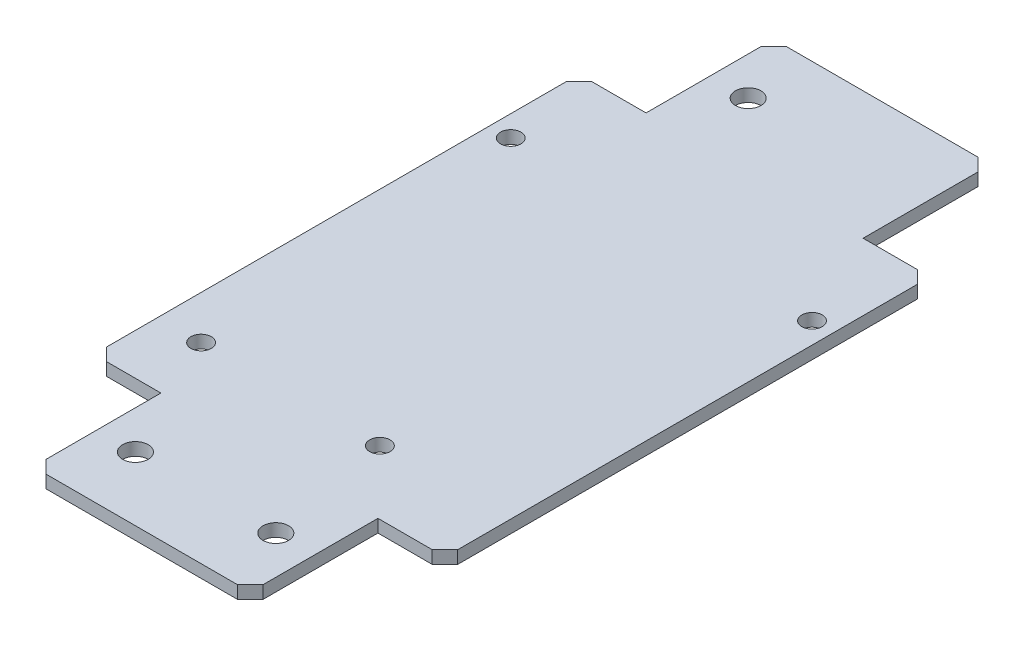
ISO-10303-21;
HEADER;
FILE_DESCRIPTION(('STEP AP214'),'2;1');
FILE_NAME('part.step','',(''),(''),'','','');
FILE_SCHEMA(('AUTOMOTIVE_DESIGN { 1 0 10303 214 1 1 1 1 }'));
ENDSEC;
DATA;
#1=APPLICATION_CONTEXT('core data for automotive mechanical design processes');
#2=APPLICATION_PROTOCOL_DEFINITION('international standard','automotive_design',2000,#1);
#3=PRODUCT_CONTEXT('',#1,'mechanical');
#4=PRODUCT('Part','Part','',(#3));
#5=PRODUCT_RELATED_PRODUCT_CATEGORY('part','',(#4));
#6=PRODUCT_DEFINITION_FORMATION('','',#4);
#7=PRODUCT_DEFINITION_CONTEXT('part definition',#1,'design');
#8=PRODUCT_DEFINITION('design','',#6,#7);
#9=PRODUCT_DEFINITION_SHAPE('','',#8);
#10=(LENGTH_UNIT() NAMED_UNIT(*) SI_UNIT(.MILLI.,.METRE.));
#11=(NAMED_UNIT(*) PLANE_ANGLE_UNIT() SI_UNIT($,.RADIAN.));
#12=(NAMED_UNIT(*) SI_UNIT($,.STERADIAN.) SOLID_ANGLE_UNIT());
#13=UNCERTAINTY_MEASURE_WITH_UNIT(LENGTH_MEASURE(1.E-05),#10,'distance_accuracy_value','');
#14=(GEOMETRIC_REPRESENTATION_CONTEXT(3) GLOBAL_UNCERTAINTY_ASSIGNED_CONTEXT((#13)) GLOBAL_UNIT_ASSIGNED_CONTEXT((#10,
#11,#12)) REPRESENTATION_CONTEXT('',''));
#15=CARTESIAN_POINT('',(0.,0.,0.));
#16=DIRECTION('',(0.,0.,1.));
#17=DIRECTION('',(1.,0.,0.));
#18=AXIS2_PLACEMENT_3D('',#15,#16,#17);
#19=CARTESIAN_POINT('',(0.,52.6628022130798,0.));
#20=DIRECTION('',(0.,1.,0.));
#21=DIRECTION('',(-1.,0.,0.));
#22=AXIS2_PLACEMENT_3D('',#19,#20,#21);
#23=PLANE('',#22);
#24=CARTESIAN_POINT('',(-92.9032323710013,52.6628022130797,54.));
#25=DIRECTION('',(0.,1.,0.));
#26=DIRECTION('',(-1.,0.,0.));
#27=AXIS2_PLACEMENT_3D('',#24,#25,#26);
#28=CIRCLE('',#27,1.60000000000148);
#29=CARTESIAN_POINT('',(-94.5032323710028,52.6628022130797,54.));
#30=VERTEX_POINT('',#29);
#31=EDGE_CURVE('E271',#30,#30,#28,.T.);
#32=ORIENTED_EDGE('',*,*,#31,.F.);
#33=EDGE_LOOP('',(#32));
#34=FACE_BOUND('',#33,.T.);
#35=CARTESIAN_POINT('',(-61.4032323710013,52.6628022130797,106.));
#36=DIRECTION('',(0.,1.,0.));
#37=DIRECTION('',(-1.,0.,0.));
#38=AXIS2_PLACEMENT_3D('',#35,#36,#37);
#39=CIRCLE('',#38,1.60000000000148);
#40=CARTESIAN_POINT('',(-63.0032323710028,52.6628022130797,106.));
#41=VERTEX_POINT('',#40);
#42=EDGE_CURVE('E483',#41,#41,#39,.T.);
#43=ORIENTED_EDGE('',*,*,#42,.F.);
#44=EDGE_LOOP('',(#43));
#45=FACE_BOUND('',#44,.T.);
#46=CARTESIAN_POINT('',(-89.4032323710013,52.6628022130797,106.));
#47=DIRECTION('',(0.,1.,0.));
#48=DIRECTION('',(-1.,0.,0.));
#49=AXIS2_PLACEMENT_3D('',#46,#47,#48);
#50=CIRCLE('',#49,1.60000000000148);
#51=CARTESIAN_POINT('',(-91.0032323710028,52.6628022130797,106.));
#52=VERTEX_POINT('',#51);
#53=EDGE_CURVE('E480',#52,#52,#50,.T.);
#54=ORIENTED_EDGE('',*,*,#53,.F.);
#55=EDGE_LOOP('',(#54));
#56=FACE_BOUND('',#55,.T.);
#57=CARTESIAN_POINT('',(-44.5032323710013,52.6628022130798,55.2));
#58=DIRECTION('',(0.,1.,0.));
#59=DIRECTION('',(-1.,0.,0.));
#60=AXIS2_PLACEMENT_3D('',#57,#58,#59);
#61=CIRCLE('',#60,1.60000000000147);
#62=CARTESIAN_POINT('',(-46.1032323710027,52.6628022130798,55.2));
#63=VERTEX_POINT('',#62);
#64=EDGE_CURVE('E477',#63,#63,#61,.T.);
#65=ORIENTED_EDGE('',*,*,#64,.F.);
#66=EDGE_LOOP('',(#65));
#67=FACE_BOUND('',#66,.T.);
#68=CARTESIAN_POINT('',(-79.7032323710013,52.6628022130797,30.));
#69=DIRECTION('',(0.,1.,0.));
#70=DIRECTION('',(0.,0.,1.));
#71=AXIS2_PLACEMENT_3D('',#68,#69,#70);
#72=CIRCLE('',#71,2.);
#73=CARTESIAN_POINT('',(-79.7032323710013,52.6628022130797,32.));
#74=VERTEX_POINT('',#73);
#75=EDGE_CURVE('E494',#74,#74,#72,.T.);
#76=ORIENTED_EDGE('',*,*,#75,.F.);
#77=EDGE_LOOP('',(#76));
#78=FACE_BOUND('',#77,.T.);
#79=DIRECTION('',(0.,0.,-1.));
#80=VECTOR('',#79,1.);
#81=CARTESIAN_POINT('',(-41.2032323710012,52.6628022130797,116.));
#82=LINE('',#81,#80);
#83=CARTESIAN_POINT('',(-41.2032323710012,52.6628022130797,114.));
#84=VERTEX_POINT('',#83);
#85=CARTESIAN_POINT('',(-41.2032323710012,52.6628022130798,42.));
#86=VERTEX_POINT('',#85);
#87=EDGE_CURVE('E224',#84,#86,#82,.T.);
#88=ORIENTED_EDGE('',*,*,#87,.T.);
#89=DIRECTION('',(0.707106781186546,0.,0.707106781186549));
#90=VECTOR('',#89,1.);
#91=CARTESIAN_POINT('',(-41.6016161855007,52.6628022130798,41.6016161855006));
#92=LINE('',#91,#90);
#93=CARTESIAN_POINT('',(-43.2032323710012,52.6628022130798,40.));
#94=VERTEX_POINT('',#93);
#95=EDGE_CURVE('E317',#86,#94,#92,.F.);
#96=ORIENTED_EDGE('',*,*,#95,.T.);
#97=DIRECTION('',(-1.,0.,0.));
#98=VECTOR('',#97,1.);
#99=CARTESIAN_POINT('',(-41.2032323710012,52.6628022130798,40.));
#100=LINE('',#99,#98);
#101=CARTESIAN_POINT('',(-51.7032323710012,52.6628022130798,40.));
#102=VERTEX_POINT('',#101);
#103=EDGE_CURVE('E226',#94,#102,#100,.T.);
#104=ORIENTED_EDGE('',*,*,#103,.T.);
#105=DIRECTION('',(0.,0.,-1.));
#106=VECTOR('',#105,1.);
#107=CARTESIAN_POINT('',(-51.7032323710012,52.6628022130798,40.));
#108=LINE('',#107,#106);
#109=CARTESIAN_POINT('',(-51.7032323710012,52.6628022130798,22.));
#110=VERTEX_POINT('',#109);
#111=EDGE_CURVE('E228',#102,#110,#108,.T.);
#112=ORIENTED_EDGE('',*,*,#111,.T.);
#113=DIRECTION('',(0.707106781186548,0.,0.707106781186548));
#114=VECTOR('',#113,1.);
#115=CARTESIAN_POINT('',(-36.8516161855006,52.6628022130798,36.8516161855006));
#116=LINE('',#115,#114);
#117=CARTESIAN_POINT('',(-53.7032323710012,52.6628022130798,20.));
#118=VERTEX_POINT('',#117);
#119=EDGE_CURVE('E304',#110,#118,#116,.F.);
#120=ORIENTED_EDGE('',*,*,#119,.T.);
#121=DIRECTION('',(-1.,0.,0.));
#122=VECTOR('',#121,1.);
#123=CARTESIAN_POINT('',(-51.7032323710012,52.6628022130798,20.));
#124=LINE('',#123,#122);
#125=CARTESIAN_POINT('',(-83.7032323710012,52.6628022130797,20.));
#126=VERTEX_POINT('',#125);
#127=EDGE_CURVE('E190',#118,#126,#124,.T.);
#128=ORIENTED_EDGE('',*,*,#127,.T.);
#129=DIRECTION('',(0.70710678118655,0.,-0.707106781186545));
#130=VECTOR('',#129,1.);
#131=CARTESIAN_POINT('',(-31.8516161855003,52.6628022130798,-31.8516161855005));
#132=LINE('',#131,#130);
#133=CARTESIAN_POINT('',(-85.7032323710013,52.6628022130797,22.));
#134=VERTEX_POINT('',#133);
#135=EDGE_CURVE('E186',#126,#134,#132,.F.);
#136=ORIENTED_EDGE('',*,*,#135,.T.);
#137=DIRECTION('',(0.,0.,1.));
#138=VECTOR('',#137,1.);
#139=CARTESIAN_POINT('',(-85.7032323710013,52.6628022130797,20.));
#140=LINE('',#139,#138);
#141=CARTESIAN_POINT('',(-85.7032323710013,52.6628022130797,40.));
#142=VERTEX_POINT('',#141);
#143=EDGE_CURVE('E177',#134,#142,#140,.T.);
#144=ORIENTED_EDGE('',*,*,#143,.T.);
#145=DIRECTION('',(-1.,0.,0.));
#146=VECTOR('',#145,1.);
#147=CARTESIAN_POINT('',(-85.7032323710013,52.6628022130797,40.));
#148=LINE('',#147,#146);
#149=CARTESIAN_POINT('',(-94.2032323710012,52.6628022130797,40.));
#150=VERTEX_POINT('',#149);
#151=EDGE_CURVE('E182',#142,#150,#148,.T.);
#152=ORIENTED_EDGE('',*,*,#151,.T.);
#153=DIRECTION('',(0.70710678118655,0.,-0.707106781186545));
#154=VECTOR('',#153,1.);
#155=CARTESIAN_POINT('',(-27.1016161855003,52.6628022130798,-27.1016161855005));
#156=LINE('',#155,#154);
#157=CARTESIAN_POINT('',(-96.2032323710013,52.6628022130797,42.));
#158=VERTEX_POINT('',#157);
#159=EDGE_CURVE('E307',#150,#158,#156,.F.);
#160=ORIENTED_EDGE('',*,*,#159,.T.);
#161=DIRECTION('',(0.,0.,1.));
#162=VECTOR('',#161,1.);
#163=CARTESIAN_POINT('',(-96.2032323710013,52.6628022130797,40.));
#164=LINE('',#163,#162);
#165=CARTESIAN_POINT('',(-96.2032323710012,52.6628022130797,114.));
#166=VERTEX_POINT('',#165);
#167=EDGE_CURVE('E206',#158,#166,#164,.T.);
#168=ORIENTED_EDGE('',*,*,#167,.T.);
#169=DIRECTION('',(-0.70710678118655,0.,-0.707106781186545));
#170=VECTOR('',#169,1.);
#171=CARTESIAN_POINT('',(-105.1016161855,52.6628022130797,105.101616185501));
#172=LINE('',#171,#170);
#173=CARTESIAN_POINT('',(-94.2032323710013,52.6628022130797,116.));
#174=VERTEX_POINT('',#173);
#175=EDGE_CURVE('E309',#166,#174,#172,.F.);
#176=ORIENTED_EDGE('',*,*,#175,.T.);
#177=DIRECTION('',(1.,0.,0.));
#178=VECTOR('',#177,1.);
#179=CARTESIAN_POINT('',(-96.2032323710012,52.6628022130797,116.));
#180=LINE('',#179,#178);
#181=CARTESIAN_POINT('',(-85.7032323710012,52.6628022130797,116.));
#182=VERTEX_POINT('',#181);
#183=EDGE_CURVE('E209',#174,#182,#180,.T.);
#184=ORIENTED_EDGE('',*,*,#183,.T.);
#185=DIRECTION('',(0.,0.,1.));
#186=VECTOR('',#185,1.);
#187=CARTESIAN_POINT('',(-85.7032323710012,52.6628022130797,116.));
#188=LINE('',#187,#186);
#189=CARTESIAN_POINT('',(-85.7032323710012,52.6628022130797,134.));
#190=VERTEX_POINT('',#189);
#191=EDGE_CURVE('E214',#182,#190,#188,.T.);
#192=ORIENTED_EDGE('',*,*,#191,.T.);
#193=DIRECTION('',(-0.707106781186538,0.,-0.707106781186557));
#194=VECTOR('',#193,1.);
#195=CARTESIAN_POINT('',(-109.851616185502,52.6628022130797,109.851616185499));
#196=LINE('',#195,#194);
#197=CARTESIAN_POINT('',(-83.7032323710013,52.6628022130797,136.));
#198=VERTEX_POINT('',#197);
#199=EDGE_CURVE('E311',#190,#198,#196,.F.);
#200=ORIENTED_EDGE('',*,*,#199,.T.);
#201=DIRECTION('',(1.,0.,0.));
#202=VECTOR('',#201,1.);
#203=CARTESIAN_POINT('',(-85.7032323710012,52.6628022130797,136.));
#204=LINE('',#203,#202);
#205=CARTESIAN_POINT('',(-53.7032323710013,52.6628022130797,136.));
#206=VERTEX_POINT('',#205);
#207=EDGE_CURVE('E217',#198,#206,#204,.T.);
#208=ORIENTED_EDGE('',*,*,#207,.T.);
#209=DIRECTION('',(-0.707106781186545,0.,0.70710678118655));
#210=VECTOR('',#209,1.);
#211=CARTESIAN_POINT('',(41.1483838144992,52.6628022130798,41.148383814499));
#212=LINE('',#211,#210);
#213=CARTESIAN_POINT('',(-51.7032323710012,52.6628022130797,134.));
#214=VERTEX_POINT('',#213);
#215=EDGE_CURVE('E313',#206,#214,#212,.F.);
#216=ORIENTED_EDGE('',*,*,#215,.T.);
#217=DIRECTION('',(0.,0.,-1.));
#218=VECTOR('',#217,1.);
#219=CARTESIAN_POINT('',(-51.7032323710012,52.6628022130797,136.));
#220=LINE('',#219,#218);
#221=CARTESIAN_POINT('',(-51.7032323710012,52.6628022130797,116.));
#222=VERTEX_POINT('',#221);
#223=EDGE_CURVE('E220',#214,#222,#220,.T.);
#224=ORIENTED_EDGE('',*,*,#223,.T.);
#225=DIRECTION('',(1.,0.,0.));
#226=VECTOR('',#225,1.);
#227=CARTESIAN_POINT('',(-51.7032323710012,52.6628022130797,116.));
#228=LINE('',#227,#226);
#229=CARTESIAN_POINT('',(-43.2032323710012,52.6628022130797,116.));
#230=VERTEX_POINT('',#229);
#231=EDGE_CURVE('E222',#222,#230,#228,.T.);
#232=ORIENTED_EDGE('',*,*,#231,.T.);
#233=DIRECTION('',(-0.70710678118655,0.,0.707106781186545));
#234=VECTOR('',#233,1.);
#235=CARTESIAN_POINT('',(36.3983838144996,52.6628022130798,36.3983838144999));
#236=LINE('',#235,#234);
#237=EDGE_CURVE('E315',#230,#84,#236,.F.);
#238=ORIENTED_EDGE('',*,*,#237,.T.);
#239=EDGE_LOOP('',(#88,#96,#104,#112,#120,#128,#136,#144,#152,#160,#168,#176,#184,#192,#200,
#208,#216,#224,#232,#238));
#240=FACE_BOUND('',#239,.T.);
#241=CARTESIAN_POINT('',(-79.7032323710012,52.6628022130797,126.));
#242=DIRECTION('',(0.,1.,0.));
#243=DIRECTION('',(0.,0.,1.));
#244=AXIS2_PLACEMENT_3D('',#241,#242,#243);
#245=CIRCLE('',#244,2.);
#246=CARTESIAN_POINT('',(-79.7032323710012,52.6628022130797,128.));
#247=VERTEX_POINT('',#246);
#248=EDGE_CURVE('E234',#247,#247,#245,.T.);
#249=ORIENTED_EDGE('',*,*,#248,.F.);
#250=EDGE_LOOP('',(#249));
#251=FACE_BOUND('',#250,.T.);
#252=CARTESIAN_POINT('',(-57.7032323710012,52.6628022130797,126.));
#253=DIRECTION('',(0.,1.,0.));
#254=DIRECTION('',(0.,0.,1.));
#255=AXIS2_PLACEMENT_3D('',#252,#253,#254);
#256=CIRCLE('',#255,2.);
#257=CARTESIAN_POINT('',(-57.7032323710012,52.6628022130797,128.));
#258=VERTEX_POINT('',#257);
#259=EDGE_CURVE('E488',#258,#258,#256,.T.);
#260=ORIENTED_EDGE('',*,*,#259,.F.);
#261=EDGE_LOOP('',(#260));
#262=FACE_BOUND('',#261,.T.);
#263=ADVANCED_FACE('F37',(#34,#45,#56,#67,#78,#240,#251,#262),#23,.T.);
#264=CARTESIAN_POINT('',(0.,50.6628022130798,0.));
#265=DIRECTION('',(0.,1.,0.));
#266=DIRECTION('',(-1.,0.,0.));
#267=AXIS2_PLACEMENT_3D('',#264,#265,#266);
#268=PLANE('',#267);
#269=CARTESIAN_POINT('',(-92.9032323710013,50.6628022130797,54.));
#270=DIRECTION('',(0.,1.,0.));
#271=DIRECTION('',(-1.,0.,0.));
#272=AXIS2_PLACEMENT_3D('',#269,#270,#271);
#273=CIRCLE('',#272,1.60000000000148);
#274=CARTESIAN_POINT('',(-94.5032323710028,50.6628022130797,54.));
#275=VERTEX_POINT('',#274);
#276=EDGE_CURVE('E277',#275,#275,#273,.T.);
#277=ORIENTED_EDGE('',*,*,#276,.T.);
#278=EDGE_LOOP('',(#277));
#279=FACE_BOUND('',#278,.T.);
#280=CARTESIAN_POINT('',(-61.4032323710013,50.6628022130797,106.));
#281=DIRECTION('',(0.,1.,0.));
#282=DIRECTION('',(-1.,0.,0.));
#283=AXIS2_PLACEMENT_3D('',#280,#281,#282);
#284=CIRCLE('',#283,1.60000000000148);
#285=CARTESIAN_POINT('',(-63.0032323710027,50.6628022130797,106.));
#286=VERTEX_POINT('',#285);
#287=EDGE_CURVE('E274',#286,#286,#284,.T.);
#288=ORIENTED_EDGE('',*,*,#287,.T.);
#289=EDGE_LOOP('',(#288));
#290=FACE_BOUND('',#289,.T.);
#291=CARTESIAN_POINT('',(-89.4032323710013,50.6628022130797,106.));
#292=DIRECTION('',(0.,1.,0.));
#293=DIRECTION('',(-1.,0.,0.));
#294=AXIS2_PLACEMENT_3D('',#291,#292,#293);
#295=CIRCLE('',#294,1.60000000000148);
#296=CARTESIAN_POINT('',(-91.0032323710028,50.6628022130797,106.));
#297=VERTEX_POINT('',#296);
#298=EDGE_CURVE('E270',#297,#297,#295,.T.);
#299=ORIENTED_EDGE('',*,*,#298,.T.);
#300=EDGE_LOOP('',(#299));
#301=FACE_BOUND('',#300,.T.);
#302=CARTESIAN_POINT('',(-44.5032323710013,50.6628022130798,55.2));
#303=DIRECTION('',(0.,1.,0.));
#304=DIRECTION('',(-1.,0.,0.));
#305=AXIS2_PLACEMENT_3D('',#302,#303,#304);
#306=CIRCLE('',#305,1.60000000000147);
#307=CARTESIAN_POINT('',(-46.1032323710027,50.6628022130798,55.2));
#308=VERTEX_POINT('',#307);
#309=EDGE_CURVE('E267',#308,#308,#306,.T.);
#310=ORIENTED_EDGE('',*,*,#309,.T.);
#311=EDGE_LOOP('',(#310));
#312=FACE_BOUND('',#311,.T.);
#313=DIRECTION('',(-1.,0.,0.));
#314=VECTOR('',#313,1.);
#315=CARTESIAN_POINT('',(-41.2032323710012,50.6628022130798,40.));
#316=LINE('',#315,#314);
#317=CARTESIAN_POINT('',(-43.2032323710012,50.6628022130798,40.));
#318=VERTEX_POINT('',#317);
#319=CARTESIAN_POINT('',(-51.7032323710012,50.6628022130798,40.));
#320=VERTEX_POINT('',#319);
#321=EDGE_CURVE('E256',#318,#320,#316,.T.);
#322=ORIENTED_EDGE('',*,*,#321,.F.);
#323=DIRECTION('',(-0.707106781186546,0.,-0.707106781186549));
#324=VECTOR('',#323,1.);
#325=CARTESIAN_POINT('',(-43.2032323710012,50.6628022130798,40.));
#326=LINE('',#325,#324);
#327=CARTESIAN_POINT('',(-41.2032323710012,50.6628022130798,42.));
#328=VERTEX_POINT('',#327);
#329=EDGE_CURVE('E297',#318,#328,#326,.F.);
#330=ORIENTED_EDGE('',*,*,#329,.T.);
#331=DIRECTION('',(0.,0.,-1.));
#332=VECTOR('',#331,1.);
#333=CARTESIAN_POINT('',(-41.2032323710012,50.6628022130797,116.));
#334=LINE('',#333,#332);
#335=CARTESIAN_POINT('',(-41.2032323710012,50.6628022130797,114.));
#336=VERTEX_POINT('',#335);
#337=EDGE_CURVE('E253',#336,#328,#334,.T.);
#338=ORIENTED_EDGE('',*,*,#337,.F.);
#339=DIRECTION('',(0.70710678118655,0.,-0.707106781186545));
#340=VECTOR('',#339,1.);
#341=CARTESIAN_POINT('',(-41.2032323710012,50.6628022130797,114.));
#342=LINE('',#341,#340);
#343=CARTESIAN_POINT('',(-43.2032323710012,50.6628022130797,116.));
#344=VERTEX_POINT('',#343);
#345=EDGE_CURVE('E295',#336,#344,#342,.F.);
#346=ORIENTED_EDGE('',*,*,#345,.T.);
#347=DIRECTION('',(1.,0.,0.));
#348=VECTOR('',#347,1.);
#349=CARTESIAN_POINT('',(-51.7032323710012,50.6628022130797,116.));
#350=LINE('',#349,#348);
#351=CARTESIAN_POINT('',(-51.7032323710012,50.6628022130797,116.));
#352=VERTEX_POINT('',#351);
#353=EDGE_CURVE('E251',#352,#344,#350,.T.);
#354=ORIENTED_EDGE('',*,*,#353,.F.);
#355=DIRECTION('',(0.,0.,-1.));
#356=VECTOR('',#355,1.);
#357=CARTESIAN_POINT('',(-51.7032323710012,50.6628022130797,136.));
#358=LINE('',#357,#356);
#359=CARTESIAN_POINT('',(-51.7032323710012,50.6628022130797,134.));
#360=VERTEX_POINT('',#359);
#361=EDGE_CURVE('E249',#360,#352,#358,.T.);
#362=ORIENTED_EDGE('',*,*,#361,.F.);
#363=DIRECTION('',(0.707106781186545,0.,-0.70710678118655));
#364=VECTOR('',#363,1.);
#365=CARTESIAN_POINT('',(-51.7032323710012,50.6628022130797,134.));
#366=LINE('',#365,#364);
#367=CARTESIAN_POINT('',(-53.7032323710013,50.6628022130797,136.));
#368=VERTEX_POINT('',#367);
#369=EDGE_CURVE('E293',#360,#368,#366,.F.);
#370=ORIENTED_EDGE('',*,*,#369,.T.);
#371=DIRECTION('',(1.,0.,0.));
#372=VECTOR('',#371,1.);
#373=CARTESIAN_POINT('',(-85.7032323710012,50.6628022130797,136.));
#374=LINE('',#373,#372);
#375=CARTESIAN_POINT('',(-83.7032323710013,50.6628022130797,136.));
#376=VERTEX_POINT('',#375);
#377=EDGE_CURVE('E246',#376,#368,#374,.T.);
#378=ORIENTED_EDGE('',*,*,#377,.F.);
#379=DIRECTION('',(0.707106781186538,0.,0.707106781186557));
#380=VECTOR('',#379,1.);
#381=CARTESIAN_POINT('',(-83.7032323710013,50.6628022130797,136.));
#382=LINE('',#381,#380);
#383=CARTESIAN_POINT('',(-85.7032323710012,50.6628022130797,134.));
#384=VERTEX_POINT('',#383);
#385=EDGE_CURVE('E291',#376,#384,#382,.F.);
#386=ORIENTED_EDGE('',*,*,#385,.T.);
#387=DIRECTION('',(0.,0.,1.));
#388=VECTOR('',#387,1.);
#389=CARTESIAN_POINT('',(-85.7032323710012,50.6628022130797,116.));
#390=LINE('',#389,#388);
#391=CARTESIAN_POINT('',(-85.7032323710012,50.6628022130797,116.));
#392=VERTEX_POINT('',#391);
#393=EDGE_CURVE('E243',#392,#384,#390,.T.);
#394=ORIENTED_EDGE('',*,*,#393,.F.);
#395=DIRECTION('',(1.,0.,0.));
#396=VECTOR('',#395,1.);
#397=CARTESIAN_POINT('',(-96.2032323710012,50.6628022130797,116.));
#398=LINE('',#397,#396);
#399=CARTESIAN_POINT('',(-94.2032323710013,50.6628022130797,116.));
#400=VERTEX_POINT('',#399);
#401=EDGE_CURVE('E241',#400,#392,#398,.T.);
#402=ORIENTED_EDGE('',*,*,#401,.F.);
#403=DIRECTION('',(0.70710678118655,0.,0.707106781186545));
#404=VECTOR('',#403,1.);
#405=CARTESIAN_POINT('',(-94.2032323710013,50.6628022130797,116.));
#406=LINE('',#405,#404);
#407=CARTESIAN_POINT('',(-96.2032323710012,50.6628022130797,114.));
#408=VERTEX_POINT('',#407);
#409=EDGE_CURVE('E289',#400,#408,#406,.F.);
#410=ORIENTED_EDGE('',*,*,#409,.T.);
#411=DIRECTION('',(0.,0.,1.));
#412=VECTOR('',#411,1.);
#413=CARTESIAN_POINT('',(-96.2032323710013,50.6628022130797,40.));
#414=LINE('',#413,#412);
#415=CARTESIAN_POINT('',(-96.2032323710013,50.6628022130797,42.));
#416=VERTEX_POINT('',#415);
#417=EDGE_CURVE('E238',#416,#408,#414,.T.);
#418=ORIENTED_EDGE('',*,*,#417,.F.);
#419=DIRECTION('',(-0.70710678118655,0.,0.707106781186545));
#420=VECTOR('',#419,1.);
#421=CARTESIAN_POINT('',(-96.2032323710013,50.6628022130797,42.));
#422=LINE('',#421,#420);
#423=CARTESIAN_POINT('',(-94.2032323710012,50.6628022130797,40.));
#424=VERTEX_POINT('',#423);
#425=EDGE_CURVE('E287',#416,#424,#422,.F.);
#426=ORIENTED_EDGE('',*,*,#425,.T.);
#427=DIRECTION('',(-1.,0.,0.));
#428=VECTOR('',#427,1.);
#429=CARTESIAN_POINT('',(-85.7032323710013,50.6628022130797,40.));
#430=LINE('',#429,#428);
#431=CARTESIAN_POINT('',(-85.7032323710013,50.6628022130797,40.));
#432=VERTEX_POINT('',#431);
#433=EDGE_CURVE('E236',#432,#424,#430,.T.);
#434=ORIENTED_EDGE('',*,*,#433,.F.);
#435=DIRECTION('',(0.,0.,1.));
#436=VECTOR('',#435,1.);
#437=CARTESIAN_POINT('',(-85.7032323710013,50.6628022130797,20.));
#438=LINE('',#437,#436);
#439=CARTESIAN_POINT('',(-85.7032323710013,50.6628022130797,22.));
#440=VERTEX_POINT('',#439);
#441=EDGE_CURVE('E196',#440,#432,#438,.T.);
#442=ORIENTED_EDGE('',*,*,#441,.F.);
#443=DIRECTION('',(-0.70710678118655,0.,0.707106781186545));
#444=VECTOR('',#443,1.);
#445=CARTESIAN_POINT('',(-85.7032323710013,50.6628022130797,22.));
#446=LINE('',#445,#444);
#447=CARTESIAN_POINT('',(-83.7032323710012,50.6628022130797,20.));
#448=VERTEX_POINT('',#447);
#449=EDGE_CURVE('E285',#440,#448,#446,.F.);
#450=ORIENTED_EDGE('',*,*,#449,.T.);
#451=DIRECTION('',(-1.,0.,0.));
#452=VECTOR('',#451,1.);
#453=CARTESIAN_POINT('',(-51.7032323710012,50.6628022130798,20.));
#454=LINE('',#453,#452);
#455=CARTESIAN_POINT('',(-53.7032323710012,50.6628022130798,20.));
#456=VERTEX_POINT('',#455);
#457=EDGE_CURVE('E231',#456,#448,#454,.T.);
#458=ORIENTED_EDGE('',*,*,#457,.F.);
#459=DIRECTION('',(-0.707106781186548,0.,-0.707106781186548));
#460=VECTOR('',#459,1.);
#461=CARTESIAN_POINT('',(-53.7032323710012,50.6628022130798,20.));
#462=LINE('',#461,#460);
#463=CARTESIAN_POINT('',(-51.7032323710012,50.6628022130798,22.));
#464=VERTEX_POINT('',#463);
#465=EDGE_CURVE('E283',#456,#464,#462,.F.);
#466=ORIENTED_EDGE('',*,*,#465,.T.);
#467=DIRECTION('',(0.,0.,-1.));
#468=VECTOR('',#467,1.);
#469=CARTESIAN_POINT('',(-51.7032323710012,50.6628022130798,40.));
#470=LINE('',#469,#468);
#471=EDGE_CURVE('E258',#320,#464,#470,.T.);
#472=ORIENTED_EDGE('',*,*,#471,.F.);
#473=EDGE_LOOP('',(#322,#330,#338,#346,#354,#362,#370,#378,#386,#394,#402,#410,#418,#426,#434,
#442,#450,#458,#466,#472));
#474=FACE_BOUND('',#473,.T.);
#475=CARTESIAN_POINT('',(-79.7032323710012,50.6628022130797,126.));
#476=DIRECTION('',(0.,1.,0.));
#477=DIRECTION('',(0.,0.,1.));
#478=AXIS2_PLACEMENT_3D('',#475,#476,#477);
#479=CIRCLE('',#478,2.);
#480=CARTESIAN_POINT('',(-79.7032323710012,50.6628022130797,128.));
#481=VERTEX_POINT('',#480);
#482=EDGE_CURVE('E497',#481,#481,#479,.T.);
#483=ORIENTED_EDGE('',*,*,#482,.T.);
#484=EDGE_LOOP('',(#483));
#485=FACE_BOUND('',#484,.T.);
#486=CARTESIAN_POINT('',(-79.7032323710013,50.6628022130797,30.));
#487=DIRECTION('',(0.,1.,0.));
#488=DIRECTION('',(0.,0.,1.));
#489=AXIS2_PLACEMENT_3D('',#486,#487,#488);
#490=CIRCLE('',#489,2.);
#491=CARTESIAN_POINT('',(-79.7032323710013,50.6628022130797,32.));
#492=VERTEX_POINT('',#491);
#493=EDGE_CURVE('E491',#492,#492,#490,.T.);
#494=ORIENTED_EDGE('',*,*,#493,.T.);
#495=EDGE_LOOP('',(#494));
#496=FACE_BOUND('',#495,.T.);
#497=CARTESIAN_POINT('',(-57.7032323710012,50.6628022130797,126.));
#498=DIRECTION('',(0.,1.,0.));
#499=DIRECTION('',(0.,0.,1.));
#500=AXIS2_PLACEMENT_3D('',#497,#498,#499);
#501=CIRCLE('',#500,2.);
#502=CARTESIAN_POINT('',(-57.7032323710012,50.6628022130797,128.));
#503=VERTEX_POINT('',#502);
#504=EDGE_CURVE('E280',#503,#503,#501,.T.);
#505=ORIENTED_EDGE('',*,*,#504,.T.);
#506=EDGE_LOOP('',(#505));
#507=FACE_BOUND('',#506,.T.);
#508=ADVANCED_FACE('F354',(#279,#290,#301,#312,#474,#485,#496,#507),#268,.F.);
#509=CARTESIAN_POINT('',(-51.7032323710012,52.6628022130798,20.));
#510=DIRECTION('',(0.,0.,1.));
#511=DIRECTION('',(0.,-1.,0.));
#512=AXIS2_PLACEMENT_3D('',#509,#510,#511);
#513=PLANE('',#512);
#514=ORIENTED_EDGE('',*,*,#457,.T.);
#515=DIRECTION('',(0.,1.,0.));
#516=VECTOR('',#515,1.);
#517=CARTESIAN_POINT('',(-83.7032323710012,52.6628022130797,20.));
#518=LINE('',#517,#516);
#519=EDGE_CURVE('E46',#448,#126,#518,.T.);
#520=ORIENTED_EDGE('',*,*,#519,.T.);
#521=ORIENTED_EDGE('',*,*,#127,.F.);
#522=DIRECTION('',(0.,-1.,0.));
#523=VECTOR('',#522,1.);
#524=CARTESIAN_POINT('',(-53.7032323710012,52.6628022130798,20.));
#525=LINE('',#524,#523);
#526=EDGE_CURVE('E341',#118,#456,#525,.T.);
#527=ORIENTED_EDGE('',*,*,#526,.T.);
#528=EDGE_LOOP('',(#514,#520,#521,#527));
#529=FACE_BOUND('',#528,.T.);
#530=ADVANCED_FACE('F346',(#529),#513,.F.);
#531=CARTESIAN_POINT('',(-85.7032323710013,52.6628022130797,20.));
#532=DIRECTION('',(1.,0.,0.));
#533=DIRECTION('',(0.,1.,0.));
#534=AXIS2_PLACEMENT_3D('',#531,#532,#533);
#535=PLANE('',#534);
#536=ORIENTED_EDGE('',*,*,#143,.F.);
#537=DIRECTION('',(0.,-1.,0.));
#538=VECTOR('',#537,1.);
#539=CARTESIAN_POINT('',(-85.7032323710013,52.6628022130797,22.));
#540=LINE('',#539,#538);
#541=EDGE_CURVE('E339',#134,#440,#540,.T.);
#542=ORIENTED_EDGE('',*,*,#541,.T.);
#543=ORIENTED_EDGE('',*,*,#441,.T.);
#544=DIRECTION('',(0.,-1.,0.));
#545=VECTOR('',#544,1.);
#546=CARTESIAN_POINT('',(-85.7032323710013,52.6628022130797,40.));
#547=LINE('',#546,#545);
#548=EDGE_CURVE('E193',#142,#432,#547,.T.);
#549=ORIENTED_EDGE('',*,*,#548,.F.);
#550=EDGE_LOOP('',(#536,#542,#543,#549));
#551=FACE_BOUND('',#550,.T.);
#552=ADVANCED_FACE('F194',(#551),#535,.F.);
#553=CARTESIAN_POINT('',(-85.7032323710013,52.6628022130797,40.));
#554=DIRECTION('',(0.,0.,1.));
#555=DIRECTION('',(0.,-1.,0.));
#556=AXIS2_PLACEMENT_3D('',#553,#554,#555);
#557=PLANE('',#556);
#558=ORIENTED_EDGE('',*,*,#433,.T.);
#559=DIRECTION('',(0.,1.,0.));
#560=VECTOR('',#559,1.);
#561=CARTESIAN_POINT('',(-94.2032323710012,52.6628022130797,40.));
#562=LINE('',#561,#560);
#563=EDGE_CURVE('E205',#424,#150,#562,.T.);
#564=ORIENTED_EDGE('',*,*,#563,.T.);
#565=ORIENTED_EDGE('',*,*,#151,.F.);
#566=ORIENTED_EDGE('',*,*,#548,.T.);
#567=EDGE_LOOP('',(#558,#564,#565,#566));
#568=FACE_BOUND('',#567,.T.);
#569=ADVANCED_FACE('F203',(#568),#557,.F.);
#570=CARTESIAN_POINT('',(-96.2032323710013,52.6628022130797,40.));
#571=DIRECTION('',(1.,0.,0.));
#572=DIRECTION('',(0.,1.,0.));
#573=AXIS2_PLACEMENT_3D('',#570,#571,#572);
#574=PLANE('',#573);
#575=ORIENTED_EDGE('',*,*,#417,.T.);
#576=DIRECTION('',(0.,1.,0.));
#577=VECTOR('',#576,1.);
#578=CARTESIAN_POINT('',(-96.2032323710012,52.6628022130797,114.));
#579=LINE('',#578,#577);
#580=EDGE_CURVE('E336',#408,#166,#579,.T.);
#581=ORIENTED_EDGE('',*,*,#580,.T.);
#582=ORIENTED_EDGE('',*,*,#167,.F.);
#583=DIRECTION('',(0.,-1.,0.));
#584=VECTOR('',#583,1.);
#585=CARTESIAN_POINT('',(-96.2032323710013,52.6628022130797,42.));
#586=LINE('',#585,#584);
#587=EDGE_CURVE('E333',#158,#416,#586,.T.);
#588=ORIENTED_EDGE('',*,*,#587,.T.);
#589=EDGE_LOOP('',(#575,#581,#582,#588));
#590=FACE_BOUND('',#589,.T.);
#591=ADVANCED_FACE('F363',(#590),#574,.F.);
#592=CARTESIAN_POINT('',(-96.2032323710012,52.6628022130797,116.));
#593=DIRECTION('',(0.,0.,-1.));
#594=DIRECTION('',(0.,1.,0.));
#595=AXIS2_PLACEMENT_3D('',#592,#593,#594);
#596=PLANE('',#595);
#597=ORIENTED_EDGE('',*,*,#183,.F.);
#598=DIRECTION('',(0.,-1.,0.));
#599=VECTOR('',#598,1.);
#600=CARTESIAN_POINT('',(-94.2032323710013,52.6628022130797,116.));
#601=LINE('',#600,#599);
#602=EDGE_CURVE('E330',#174,#400,#601,.T.);
#603=ORIENTED_EDGE('',*,*,#602,.T.);
#604=ORIENTED_EDGE('',*,*,#401,.T.);
#605=DIRECTION('',(0.,-1.,0.));
#606=VECTOR('',#605,1.);
#607=CARTESIAN_POINT('',(-85.7032323710012,52.6628022130797,116.));
#608=LINE('',#607,#606);
#609=EDGE_CURVE('E201',#182,#392,#608,.T.);
#610=ORIENTED_EDGE('',*,*,#609,.F.);
#611=EDGE_LOOP('',(#597,#603,#604,#610));
#612=FACE_BOUND('',#611,.T.);
#613=ADVANCED_FACE('F371',(#612),#596,.F.);
#614=CARTESIAN_POINT('',(-85.7032323710012,52.6628022130797,116.));
#615=DIRECTION('',(1.,0.,0.));
#616=DIRECTION('',(0.,1.,0.));
#617=AXIS2_PLACEMENT_3D('',#614,#615,#616);
#618=PLANE('',#617);
#619=ORIENTED_EDGE('',*,*,#393,.T.);
#620=DIRECTION('',(0.,1.,0.));
#621=VECTOR('',#620,1.);
#622=CARTESIAN_POINT('',(-85.7032323710012,52.6628022130797,134.));
#623=LINE('',#622,#621);
#624=EDGE_CURVE('E328',#384,#190,#623,.T.);
#625=ORIENTED_EDGE('',*,*,#624,.T.);
#626=ORIENTED_EDGE('',*,*,#191,.F.);
#627=ORIENTED_EDGE('',*,*,#609,.T.);
#628=EDGE_LOOP('',(#619,#625,#626,#627));
#629=FACE_BOUND('',#628,.T.);
#630=ADVANCED_FACE('F376',(#629),#618,.F.);
#631=CARTESIAN_POINT('',(-85.7032323710012,52.6628022130797,136.));
#632=DIRECTION('',(0.,0.,-1.));
#633=DIRECTION('',(0.,1.,0.));
#634=AXIS2_PLACEMENT_3D('',#631,#632,#633);
#635=PLANE('',#634);
#636=ORIENTED_EDGE('',*,*,#377,.T.);
#637=DIRECTION('',(0.,1.,0.));
#638=VECTOR('',#637,1.);
#639=CARTESIAN_POINT('',(-53.7032323710013,52.6628022130797,136.));
#640=LINE('',#639,#638);
#641=EDGE_CURVE('E326',#368,#206,#640,.T.);
#642=ORIENTED_EDGE('',*,*,#641,.T.);
#643=ORIENTED_EDGE('',*,*,#207,.F.);
#644=DIRECTION('',(0.,-1.,0.));
#645=VECTOR('',#644,1.);
#646=CARTESIAN_POINT('',(-83.7032323710013,52.6628022130797,136.));
#647=LINE('',#646,#645);
#648=EDGE_CURVE('E323',#198,#376,#647,.T.);
#649=ORIENTED_EDGE('',*,*,#648,.T.);
#650=EDGE_LOOP('',(#636,#642,#643,#649));
#651=FACE_BOUND('',#650,.T.);
#652=ADVANCED_FACE('F385',(#651),#635,.F.);
#653=CARTESIAN_POINT('',(-51.7032323710012,52.6628022130797,136.));
#654=DIRECTION('',(-1.,0.,0.));
#655=DIRECTION('',(0.,-1.,0.));
#656=AXIS2_PLACEMENT_3D('',#653,#654,#655);
#657=PLANE('',#656);
#658=ORIENTED_EDGE('',*,*,#223,.F.);
#659=DIRECTION('',(0.,-1.,0.));
#660=VECTOR('',#659,1.);
#661=CARTESIAN_POINT('',(-51.7032323710012,52.6628022130797,134.));
#662=LINE('',#661,#660);
#663=EDGE_CURVE('E320',#214,#360,#662,.T.);
#664=ORIENTED_EDGE('',*,*,#663,.T.);
#665=ORIENTED_EDGE('',*,*,#361,.T.);
#666=DIRECTION('',(0.,-1.,0.));
#667=VECTOR('',#666,1.);
#668=CARTESIAN_POINT('',(-51.7032323710012,52.6628022130797,116.));
#669=LINE('',#668,#667);
#670=EDGE_CURVE('E262',#222,#352,#669,.T.);
#671=ORIENTED_EDGE('',*,*,#670,.F.);
#672=EDGE_LOOP('',(#658,#664,#665,#671));
#673=FACE_BOUND('',#672,.T.);
#674=ADVANCED_FACE('F395',(#673),#657,.F.);
#675=CARTESIAN_POINT('',(-51.7032323710012,52.6628022130797,116.));
#676=DIRECTION('',(0.,0.,-1.));
#677=DIRECTION('',(0.,1.,0.));
#678=AXIS2_PLACEMENT_3D('',#675,#676,#677);
#679=PLANE('',#678);
#680=ORIENTED_EDGE('',*,*,#353,.T.);
#681=DIRECTION('',(0.,1.,0.));
#682=VECTOR('',#681,1.);
#683=CARTESIAN_POINT('',(-43.2032323710012,52.6628022130797,116.));
#684=LINE('',#683,#682);
#685=EDGE_CURVE('E59',#344,#230,#684,.T.);
#686=ORIENTED_EDGE('',*,*,#685,.T.);
#687=ORIENTED_EDGE('',*,*,#231,.F.);
#688=ORIENTED_EDGE('',*,*,#670,.T.);
#689=EDGE_LOOP('',(#680,#686,#687,#688));
#690=FACE_BOUND('',#689,.T.);
#691=ADVANCED_FACE('F621',(#690),#679,.F.);
#692=CARTESIAN_POINT('',(-41.2032323710012,52.6628022130797,116.));
#693=DIRECTION('',(-1.,0.,0.));
#694=DIRECTION('',(0.,-1.,0.));
#695=AXIS2_PLACEMENT_3D('',#692,#693,#694);
#696=PLANE('',#695);
#697=ORIENTED_EDGE('',*,*,#337,.T.);
#698=DIRECTION('',(0.,1.,0.));
#699=VECTOR('',#698,1.);
#700=CARTESIAN_POINT('',(-41.2032323710012,52.6628022130798,42.));
#701=LINE('',#700,#699);
#702=EDGE_CURVE('E302',#328,#86,#701,.T.);
#703=ORIENTED_EDGE('',*,*,#702,.T.);
#704=ORIENTED_EDGE('',*,*,#87,.F.);
#705=DIRECTION('',(0.,-1.,0.));
#706=VECTOR('',#705,1.);
#707=CARTESIAN_POINT('',(-41.2032323710012,52.6628022130797,114.));
#708=LINE('',#707,#706);
#709=EDGE_CURVE('E299',#84,#336,#708,.T.);
#710=ORIENTED_EDGE('',*,*,#709,.T.);
#711=EDGE_LOOP('',(#697,#703,#704,#710));
#712=FACE_BOUND('',#711,.T.);
#713=ADVANCED_FACE('F404',(#712),#696,.F.);
#714=CARTESIAN_POINT('',(-41.2032323710012,52.6628022130798,40.));
#715=DIRECTION('',(0.,0.,1.));
#716=DIRECTION('',(0.,-1.,0.));
#717=AXIS2_PLACEMENT_3D('',#714,#715,#716);
#718=PLANE('',#717);
#719=ORIENTED_EDGE('',*,*,#103,.F.);
#720=DIRECTION('',(0.,-1.,0.));
#721=VECTOR('',#720,1.);
#722=CARTESIAN_POINT('',(-43.2032323710012,52.6628022130798,40.));
#723=LINE('',#722,#721);
#724=EDGE_CURVE('E200',#94,#318,#723,.T.);
#725=ORIENTED_EDGE('',*,*,#724,.T.);
#726=ORIENTED_EDGE('',*,*,#321,.T.);
#727=DIRECTION('',(0.,-1.,0.));
#728=VECTOR('',#727,1.);
#729=CARTESIAN_POINT('',(-51.7032323710012,52.6628022130798,40.));
#730=LINE('',#729,#728);
#731=EDGE_CURVE('E230',#102,#320,#730,.T.);
#732=ORIENTED_EDGE('',*,*,#731,.F.);
#733=EDGE_LOOP('',(#719,#725,#726,#732));
#734=FACE_BOUND('',#733,.T.);
#735=ADVANCED_FACE('F413',(#734),#718,.F.);
#736=CARTESIAN_POINT('',(-51.7032323710012,52.6628022130798,40.));
#737=DIRECTION('',(-1.,0.,0.));
#738=DIRECTION('',(0.,0.,1.));
#739=AXIS2_PLACEMENT_3D('',#736,#737,#738);
#740=PLANE('',#739);
#741=ORIENTED_EDGE('',*,*,#471,.T.);
#742=DIRECTION('',(0.,1.,0.));
#743=VECTOR('',#742,1.);
#744=CARTESIAN_POINT('',(-51.7032323710012,52.6628022130798,22.));
#745=LINE('',#744,#743);
#746=EDGE_CURVE('E11',#464,#110,#745,.T.);
#747=ORIENTED_EDGE('',*,*,#746,.T.);
#748=ORIENTED_EDGE('',*,*,#111,.F.);
#749=ORIENTED_EDGE('',*,*,#731,.T.);
#750=EDGE_LOOP('',(#741,#747,#748,#749));
#751=FACE_BOUND('',#750,.T.);
#752=ADVANCED_FACE('F416',(#751),#740,.F.);
#753=CARTESIAN_POINT('',(-79.7032323710012,52.6628022130797,126.));
#754=DIRECTION('',(0.,-1.,0.));
#755=DIRECTION('',(0.,0.,-1.));
#756=AXIS2_PLACEMENT_3D('',#753,#754,#755);
#757=CYLINDRICAL_SURFACE('',#756,2.);
#758=ORIENTED_EDGE('',*,*,#248,.T.);
#759=EDGE_LOOP('',(#758));
#760=FACE_BOUND('',#759,.T.);
#761=ORIENTED_EDGE('',*,*,#482,.F.);
#762=EDGE_LOOP('',(#761));
#763=FACE_BOUND('',#762,.T.);
#764=ADVANCED_FACE('F418',(#760,#763),#757,.F.);
#765=CARTESIAN_POINT('',(-79.7032323710013,52.6628022130797,30.));
#766=DIRECTION('',(0.,-1.,0.));
#767=DIRECTION('',(0.,0.,-1.));
#768=AXIS2_PLACEMENT_3D('',#765,#766,#767);
#769=CYLINDRICAL_SURFACE('',#768,2.);
#770=ORIENTED_EDGE('',*,*,#75,.T.);
#771=EDGE_LOOP('',(#770));
#772=FACE_BOUND('',#771,.T.);
#773=ORIENTED_EDGE('',*,*,#493,.F.);
#774=EDGE_LOOP('',(#773));
#775=FACE_BOUND('',#774,.T.);
#776=ADVANCED_FACE('F424',(#772,#775),#769,.F.);
#777=CARTESIAN_POINT('',(-57.7032323710012,52.6628022130797,126.));
#778=DIRECTION('',(0.,-1.,0.));
#779=DIRECTION('',(0.,0.,-1.));
#780=AXIS2_PLACEMENT_3D('',#777,#778,#779);
#781=CYLINDRICAL_SURFACE('',#780,2.);
#782=ORIENTED_EDGE('',*,*,#259,.T.);
#783=EDGE_LOOP('',(#782));
#784=FACE_BOUND('',#783,.T.);
#785=ORIENTED_EDGE('',*,*,#504,.F.);
#786=EDGE_LOOP('',(#785));
#787=FACE_BOUND('',#786,.T.);
#788=ADVANCED_FACE('F441',(#784,#787),#781,.F.);
#789=CARTESIAN_POINT('',(-44.5032323710013,42.6628022130798,55.2));
#790=DIRECTION('',(0.,1.,0.));
#791=DIRECTION('',(-1.,0.,0.));
#792=AXIS2_PLACEMENT_3D('',#789,#790,#791);
#793=CYLINDRICAL_SURFACE('',#792,1.60000000000147);
#794=ORIENTED_EDGE('',*,*,#64,.T.);
#795=EDGE_LOOP('',(#794));
#796=FACE_BOUND('',#795,.T.);
#797=ORIENTED_EDGE('',*,*,#309,.F.);
#798=EDGE_LOOP('',(#797));
#799=FACE_BOUND('',#798,.T.);
#800=ADVANCED_FACE('F445',(#796,#799),#793,.F.);
#801=CARTESIAN_POINT('',(-89.4032323710013,42.6628022130797,106.));
#802=DIRECTION('',(0.,1.,0.));
#803=DIRECTION('',(-1.,0.,0.));
#804=AXIS2_PLACEMENT_3D('',#801,#802,#803);
#805=CYLINDRICAL_SURFACE('',#804,1.60000000000148);
#806=ORIENTED_EDGE('',*,*,#53,.T.);
#807=EDGE_LOOP('',(#806));
#808=FACE_BOUND('',#807,.T.);
#809=ORIENTED_EDGE('',*,*,#298,.F.);
#810=EDGE_LOOP('',(#809));
#811=FACE_BOUND('',#810,.T.);
#812=ADVANCED_FACE('F447',(#808,#811),#805,.F.);
#813=CARTESIAN_POINT('',(-61.4032323710013,42.6628022130797,106.));
#814=DIRECTION('',(0.,1.,0.));
#815=DIRECTION('',(-1.,0.,0.));
#816=AXIS2_PLACEMENT_3D('',#813,#814,#815);
#817=CYLINDRICAL_SURFACE('',#816,1.60000000000148);
#818=ORIENTED_EDGE('',*,*,#42,.T.);
#819=EDGE_LOOP('',(#818));
#820=FACE_BOUND('',#819,.T.);
#821=ORIENTED_EDGE('',*,*,#287,.F.);
#822=EDGE_LOOP('',(#821));
#823=FACE_BOUND('',#822,.T.);
#824=ADVANCED_FACE('F450',(#820,#823),#817,.F.);
#825=CARTESIAN_POINT('',(-92.9032323710013,42.6628022130797,54.));
#826=DIRECTION('',(0.,1.,0.));
#827=DIRECTION('',(-1.,0.,0.));
#828=AXIS2_PLACEMENT_3D('',#825,#826,#827);
#829=CYLINDRICAL_SURFACE('',#828,1.60000000000148);
#830=ORIENTED_EDGE('',*,*,#31,.T.);
#831=EDGE_LOOP('',(#830));
#832=FACE_BOUND('',#831,.T.);
#833=ORIENTED_EDGE('',*,*,#276,.F.);
#834=EDGE_LOOP('',(#833));
#835=FACE_BOUND('',#834,.T.);
#836=ADVANCED_FACE('F457',(#832,#835),#829,.F.);
#837=CARTESIAN_POINT('',(-43.2032323710012,52.6628022130798,40.));
#838=DIRECTION('',(-0.707106781186549,0.,0.707106781186546));
#839=DIRECTION('',(0.,-1.,0.));
#840=AXIS2_PLACEMENT_3D('',#837,#838,#839);
#841=PLANE('',#840);
#842=ORIENTED_EDGE('',*,*,#95,.F.);
#843=ORIENTED_EDGE('',*,*,#702,.F.);
#844=ORIENTED_EDGE('',*,*,#329,.F.);
#845=ORIENTED_EDGE('',*,*,#724,.F.);
#846=EDGE_LOOP('',(#842,#843,#844,#845));
#847=FACE_BOUND('',#846,.T.);
#848=ADVANCED_FACE('F410',(#847),#841,.F.);
#849=CARTESIAN_POINT('',(-41.2032323710012,52.6628022130797,114.));
#850=DIRECTION('',(-0.707106781186545,0.,-0.70710678118655));
#851=DIRECTION('',(0.,-1.,0.));
#852=AXIS2_PLACEMENT_3D('',#849,#850,#851);
#853=PLANE('',#852);
#854=ORIENTED_EDGE('',*,*,#237,.F.);
#855=ORIENTED_EDGE('',*,*,#685,.F.);
#856=ORIENTED_EDGE('',*,*,#345,.F.);
#857=ORIENTED_EDGE('',*,*,#709,.F.);
#858=EDGE_LOOP('',(#854,#855,#856,#857));
#859=FACE_BOUND('',#858,.T.);
#860=ADVANCED_FACE('F401',(#859),#853,.F.);
#861=CARTESIAN_POINT('',(-51.7032323710012,52.6628022130797,134.));
#862=DIRECTION('',(-0.70710678118655,0.,-0.707106781186545));
#863=DIRECTION('',(0.,-1.,0.));
#864=AXIS2_PLACEMENT_3D('',#861,#862,#863);
#865=PLANE('',#864);
#866=ORIENTED_EDGE('',*,*,#215,.F.);
#867=ORIENTED_EDGE('',*,*,#641,.F.);
#868=ORIENTED_EDGE('',*,*,#369,.F.);
#869=ORIENTED_EDGE('',*,*,#663,.F.);
#870=EDGE_LOOP('',(#866,#867,#868,#869));
#871=FACE_BOUND('',#870,.T.);
#872=ADVANCED_FACE('F392',(#871),#865,.F.);
#873=CARTESIAN_POINT('',(-83.7032323710013,52.6628022130797,136.));
#874=DIRECTION('',(0.707106781186557,0.,-0.707106781186538));
#875=DIRECTION('',(0.,-1.,0.));
#876=AXIS2_PLACEMENT_3D('',#873,#874,#875);
#877=PLANE('',#876);
#878=ORIENTED_EDGE('',*,*,#199,.F.);
#879=ORIENTED_EDGE('',*,*,#624,.F.);
#880=ORIENTED_EDGE('',*,*,#385,.F.);
#881=ORIENTED_EDGE('',*,*,#648,.F.);
#882=EDGE_LOOP('',(#878,#879,#880,#881));
#883=FACE_BOUND('',#882,.T.);
#884=ADVANCED_FACE('F382',(#883),#877,.F.);
#885=CARTESIAN_POINT('',(-94.2032323710013,52.6628022130797,116.));
#886=DIRECTION('',(0.707106781186545,0.,-0.70710678118655));
#887=DIRECTION('',(0.,-1.,0.));
#888=AXIS2_PLACEMENT_3D('',#885,#886,#887);
#889=PLANE('',#888);
#890=ORIENTED_EDGE('',*,*,#175,.F.);
#891=ORIENTED_EDGE('',*,*,#580,.F.);
#892=ORIENTED_EDGE('',*,*,#409,.F.);
#893=ORIENTED_EDGE('',*,*,#602,.F.);
#894=EDGE_LOOP('',(#890,#891,#892,#893));
#895=FACE_BOUND('',#894,.T.);
#896=ADVANCED_FACE('F366',(#895),#889,.F.);
#897=CARTESIAN_POINT('',(-96.2032323710013,52.6628022130797,42.));
#898=DIRECTION('',(0.707106781186545,0.,0.70710678118655));
#899=DIRECTION('',(0.,-1.,0.));
#900=AXIS2_PLACEMENT_3D('',#897,#898,#899);
#901=PLANE('',#900);
#902=ORIENTED_EDGE('',*,*,#159,.F.);
#903=ORIENTED_EDGE('',*,*,#563,.F.);
#904=ORIENTED_EDGE('',*,*,#425,.F.);
#905=ORIENTED_EDGE('',*,*,#587,.F.);
#906=EDGE_LOOP('',(#902,#903,#904,#905));
#907=FACE_BOUND('',#906,.T.);
#908=ADVANCED_FACE('F358',(#907),#901,.F.);
#909=CARTESIAN_POINT('',(-85.7032323710013,52.6628022130797,22.));
#910=DIRECTION('',(0.707106781186545,0.,0.70710678118655));
#911=DIRECTION('',(0.,-1.,0.));
#912=AXIS2_PLACEMENT_3D('',#909,#910,#911);
#913=PLANE('',#912);
#914=ORIENTED_EDGE('',*,*,#135,.F.);
#915=ORIENTED_EDGE('',*,*,#519,.F.);
#916=ORIENTED_EDGE('',*,*,#449,.F.);
#917=ORIENTED_EDGE('',*,*,#541,.F.);
#918=EDGE_LOOP('',(#914,#915,#916,#917));
#919=FACE_BOUND('',#918,.T.);
#920=ADVANCED_FACE('F351',(#919),#913,.F.);
#921=CARTESIAN_POINT('',(-53.7032323710012,52.6628022130798,20.));
#922=DIRECTION('',(-0.707106781186547,0.,0.707106781186547));
#923=DIRECTION('',(0.,-1.,0.));
#924=AXIS2_PLACEMENT_3D('',#921,#922,#923);
#925=PLANE('',#924);
#926=ORIENTED_EDGE('',*,*,#119,.F.);
#927=ORIENTED_EDGE('',*,*,#746,.F.);
#928=ORIENTED_EDGE('',*,*,#465,.F.);
#929=ORIENTED_EDGE('',*,*,#526,.F.);
#930=EDGE_LOOP('',(#926,#927,#928,#929));
#931=FACE_BOUND('',#930,.T.);
#932=ADVANCED_FACE('F40',(#931),#925,.F.);
#933=CLOSED_SHELL('',(#263,#508,#530,#552,#569,#591,#613,#630,#652,#674,#691,#713,#735,#752,
#764,#776,#788,#800,#812,#824,#836,#848,#860,#872,#884,#896,#908,#920,#932));
#934=MANIFOLD_SOLID_BREP('B2',#933);
#935=ADVANCED_BREP_SHAPE_REPRESENTATION('',(#18,#934),#14);
#936=SHAPE_DEFINITION_REPRESENTATION(#9,#935);
ENDSEC;
END-ISO-10303-21;
